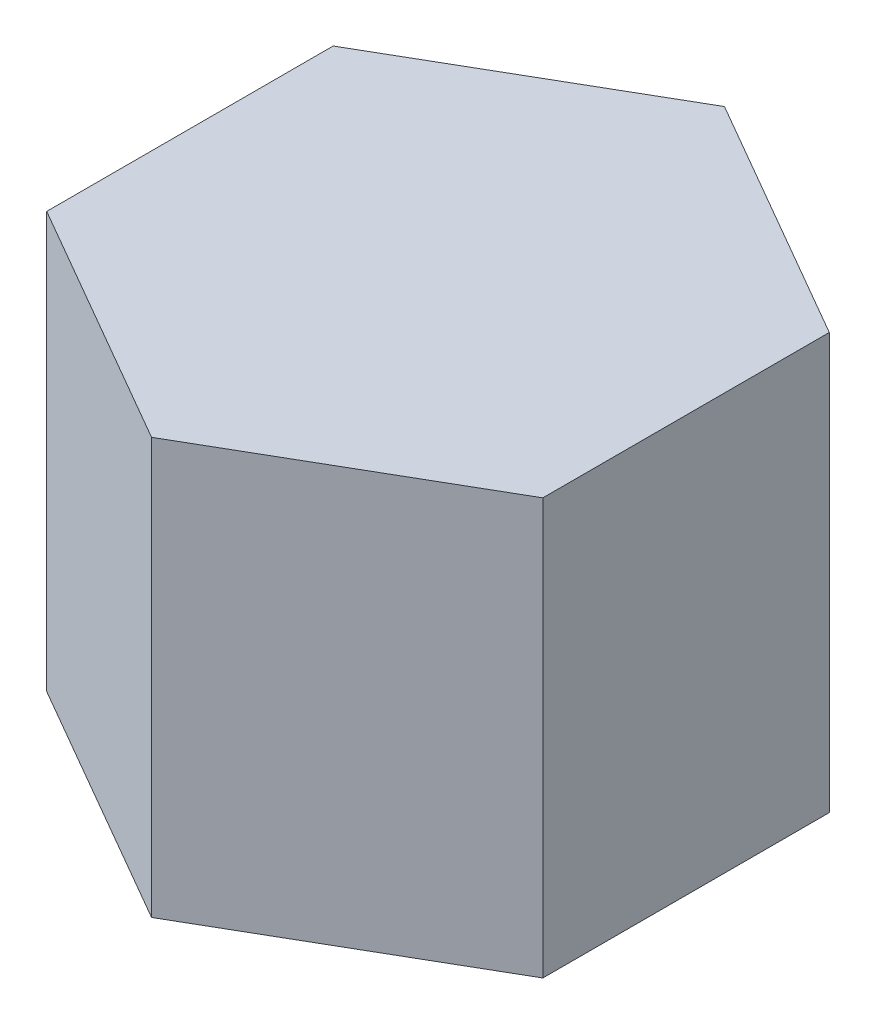
ISO-10303-21;
HEADER;
FILE_DESCRIPTION(('STEP AP214'),'2;1');
FILE_NAME('part.step','',(''),(''),'','','');
FILE_SCHEMA(('AUTOMOTIVE_DESIGN { 1 0 10303 214 1 1 1 1 }'));
ENDSEC;
DATA;
#1=APPLICATION_CONTEXT('core data for automotive mechanical design processes');
#2=APPLICATION_PROTOCOL_DEFINITION('international standard','automotive_design',2000,#1);
#3=PRODUCT_CONTEXT('',#1,'mechanical');
#4=PRODUCT('Part','Part','',(#3));
#5=PRODUCT_RELATED_PRODUCT_CATEGORY('part','',(#4));
#6=PRODUCT_DEFINITION_FORMATION('','',#4);
#7=PRODUCT_DEFINITION_CONTEXT('part definition',#1,'design');
#8=PRODUCT_DEFINITION('design','',#6,#7);
#9=PRODUCT_DEFINITION_SHAPE('','',#8);
#10=(LENGTH_UNIT() NAMED_UNIT(*) SI_UNIT(.MILLI.,.METRE.));
#11=(NAMED_UNIT(*) PLANE_ANGLE_UNIT() SI_UNIT($,.RADIAN.));
#12=(NAMED_UNIT(*) SI_UNIT($,.STERADIAN.) SOLID_ANGLE_UNIT());
#13=UNCERTAINTY_MEASURE_WITH_UNIT(LENGTH_MEASURE(1.E-05),#10,'distance_accuracy_value','');
#14=(GEOMETRIC_REPRESENTATION_CONTEXT(3) GLOBAL_UNCERTAINTY_ASSIGNED_CONTEXT((#13)) GLOBAL_UNIT_ASSIGNED_CONTEXT((#10,
#11,#12)) REPRESENTATION_CONTEXT('',''));
#15=CARTESIAN_POINT('',(0.,0.,0.));
#16=DIRECTION('',(0.,0.,1.));
#17=DIRECTION('',(1.,0.,0.));
#18=AXIS2_PLACEMENT_3D('',#15,#16,#17);
#19=CARTESIAN_POINT('',(210.142660308706,-148.537700895744,288.908895009141));
#20=DIRECTION('',(-0.499999999999943,0.,-0.866025403784472));
#21=DIRECTION('',(-0.866025403784472,0.,0.499999999999943));
#22=AXIS2_PLACEMENT_3D('',#19,#20,#21);
#23=PLANE('',#22);
#24=CARTESIAN_POINT('',(209.839551417382,-149.045793579175,289.083895009141));
#25=DIRECTION('',(0.866025403784471,0.,-0.499999999999943));
#26=VECTOR('',#25,1.);
#27=LINE('',#24,#26);
#28=CARTESIAN_POINT('',(209.839551417382,-149.045793579175,289.083895009141));
#29=VERTEX_POINT('',#28);
#30=CARTESIAN_POINT('',(210.142660308706,-149.045793579175,288.908895009141));
#31=VERTEX_POINT('',#30);
#32=EDGE_CURVE('E170',#29,#31,#27,.T.);
#33=ORIENTED_EDGE('',*,*,#32,.T.);
#34=CARTESIAN_POINT('',(210.142660308706,-148.537700895744,288.908895009141));
#35=DIRECTION('',(0.,-1.,0.));
#36=VECTOR('',#35,1.);
#37=LINE('',#34,#36);
#38=CARTESIAN_POINT('',(210.142660308706,-148.537700895744,288.908895009141));
#39=VERTEX_POINT('',#38);
#40=EDGE_CURVE('E35',#39,#31,#37,.T.);
#41=ORIENTED_EDGE('',*,*,#40,.F.);
#42=CARTESIAN_POINT('',(209.839551417382,-148.537700895744,289.083895009141));
#43=DIRECTION('',(0.866025403784471,0.,-0.499999999999943));
#44=VECTOR('',#43,1.);
#45=LINE('',#42,#44);
#46=CARTESIAN_POINT('',(209.839551417382,-148.537700895744,289.083895009141));
#47=VERTEX_POINT('',#46);
#48=EDGE_CURVE('E159',#47,#39,#45,.T.);
#49=ORIENTED_EDGE('',*,*,#48,.F.);
#50=CARTESIAN_POINT('',(209.839551417382,-148.537700895744,289.083895009141));
#51=DIRECTION('',(0.,-1.,0.));
#52=VECTOR('',#51,1.);
#53=LINE('',#50,#52);
#54=EDGE_CURVE('E10',#47,#29,#53,.T.);
#55=ORIENTED_EDGE('',*,*,#54,.T.);
#56=EDGE_LOOP('',(#33,#41,#49,#55));
#57=FACE_BOUND('',#56,.T.);
#58=ADVANCED_FACE('F16',(#57),#23,.F.);
#59=CARTESIAN_POINT('',(209.839551417382,-148.537700895744,289.083895009141));
#60=DIRECTION('',(0.500000000000062,0.,-0.866025403784403));
#61=DIRECTION('',(-0.866025403784403,0.,-0.500000000000062));
#62=AXIS2_PLACEMENT_3D('',#59,#60,#61);
#63=PLANE('',#62);
#64=CARTESIAN_POINT('',(209.536442526057,-149.045793579175,288.908895009141));
#65=DIRECTION('',(0.866025403784403,0.,0.500000000000062));
#66=VECTOR('',#65,1.);
#67=LINE('',#64,#66);
#68=CARTESIAN_POINT('',(209.536442526057,-149.045793579175,288.908895009141));
#69=VERTEX_POINT('',#68);
#70=EDGE_CURVE('E167',#69,#29,#67,.T.);
#71=ORIENTED_EDGE('',*,*,#70,.T.);
#72=ORIENTED_EDGE('',*,*,#54,.F.);
#73=CARTESIAN_POINT('',(209.536442526057,-148.537700895744,288.908895009141));
#74=DIRECTION('',(0.866025403784403,0.,0.500000000000062));
#75=VECTOR('',#74,1.);
#76=LINE('',#73,#75);
#77=CARTESIAN_POINT('',(209.536442526057,-148.537700895744,288.908895009141));
#78=VERTEX_POINT('',#77);
#79=EDGE_CURVE('E156',#78,#47,#76,.T.);
#80=ORIENTED_EDGE('',*,*,#79,.F.);
#81=CARTESIAN_POINT('',(209.536442526057,-148.537700895744,288.908895009141));
#82=DIRECTION('',(0.,-1.,0.));
#83=VECTOR('',#82,1.);
#84=LINE('',#81,#83);
#85=EDGE_CURVE('E27',#78,#69,#84,.T.);
#86=ORIENTED_EDGE('',*,*,#85,.T.);
#87=EDGE_LOOP('',(#71,#72,#80,#86));
#88=FACE_BOUND('',#87,.T.);
#89=ADVANCED_FACE('F189',(#88),#63,.F.);
#90=CARTESIAN_POINT('',(209.536442526057,-148.537700895744,290.831971220494));
#91=DIRECTION('',(1.,0.,0.));
#92=DIRECTION('',(0.,1.,0.));
#93=AXIS2_PLACEMENT_3D('',#90,#91,#92);
#94=PLANE('',#93);
#95=CARTESIAN_POINT('',(209.536442526057,-149.045793579175,288.558895009141));
#96=DIRECTION('',(0.,0.,1.));
#97=VECTOR('',#96,1.);
#98=LINE('',#95,#97);
#99=CARTESIAN_POINT('',(209.536442526057,-149.045793579175,288.558895009141));
#100=VERTEX_POINT('',#99);
#101=EDGE_CURVE('E163',#100,#69,#98,.T.);
#102=ORIENTED_EDGE('',*,*,#101,.T.);
#103=ORIENTED_EDGE('',*,*,#85,.F.);
#104=CARTESIAN_POINT('',(209.536442526057,-148.537700895744,288.558895009141));
#105=DIRECTION('',(0.,0.,1.));
#106=VECTOR('',#105,1.);
#107=LINE('',#104,#106);
#108=CARTESIAN_POINT('',(209.536442526057,-148.537700895744,288.558895009141));
#109=VERTEX_POINT('',#108);
#110=EDGE_CURVE('E106',#109,#78,#107,.T.);
#111=ORIENTED_EDGE('',*,*,#110,.F.);
#112=CARTESIAN_POINT('',(209.536442526057,-148.537700895744,288.558895009141));
#113=DIRECTION('',(0.,-1.,0.));
#114=VECTOR('',#113,1.);
#115=LINE('',#112,#114);
#116=EDGE_CURVE('E94',#109,#100,#115,.T.);
#117=ORIENTED_EDGE('',*,*,#116,.T.);
#118=EDGE_LOOP('',(#102,#103,#111,#117));
#119=FACE_BOUND('',#118,.T.);
#120=ADVANCED_FACE('F198',(#119),#94,.F.);
#121=CARTESIAN_POINT('',(209.536442526057,-148.537700895744,288.558895009141));
#122=DIRECTION('',(0.499999999999978,0.,0.866025403784452));
#123=DIRECTION('',(0.866025403784452,0.,-0.499999999999978));
#124=AXIS2_PLACEMENT_3D('',#121,#122,#123);
#125=PLANE('',#124);
#126=CARTESIAN_POINT('',(209.839551417382,-149.045793579175,288.383895009141));
#127=DIRECTION('',(-0.866025403784452,0.,0.499999999999978));
#128=VECTOR('',#127,1.);
#129=LINE('',#126,#128);
#130=CARTESIAN_POINT('',(209.839551417382,-149.045793579175,288.383895009141));
#131=VERTEX_POINT('',#130);
#132=EDGE_CURVE('E162',#131,#100,#129,.T.);
#133=ORIENTED_EDGE('',*,*,#132,.T.);
#134=ORIENTED_EDGE('',*,*,#116,.F.);
#135=CARTESIAN_POINT('',(209.839551417382,-148.537700895744,288.383895009141));
#136=DIRECTION('',(-0.866025403784452,0.,0.499999999999978));
#137=VECTOR('',#136,1.);
#138=LINE('',#135,#137);
#139=CARTESIAN_POINT('',(209.839551417382,-148.537700895744,288.383895009141));
#140=VERTEX_POINT('',#139);
#141=EDGE_CURVE('E98',#140,#109,#138,.T.);
#142=ORIENTED_EDGE('',*,*,#141,.F.);
#143=CARTESIAN_POINT('',(209.839551417382,-148.537700895744,288.383895009141));
#144=DIRECTION('',(0.,-1.,0.));
#145=VECTOR('',#144,1.);
#146=LINE('',#143,#145);
#147=EDGE_CURVE('E79',#140,#131,#146,.T.);
#148=ORIENTED_EDGE('',*,*,#147,.T.);
#149=EDGE_LOOP('',(#133,#134,#142,#148));
#150=FACE_BOUND('',#149,.T.);
#151=ADVANCED_FACE('F100',(#150),#125,.F.);
#152=CARTESIAN_POINT('',(209.839551417382,-148.537700895744,288.383895009141));
#153=DIRECTION('',(-0.499999999999943,0.,0.866025403784472));
#154=DIRECTION('',(0.866025403784472,0.,0.499999999999943));
#155=AXIS2_PLACEMENT_3D('',#152,#153,#154);
#156=PLANE('',#155);
#157=CARTESIAN_POINT('',(210.142660308706,-149.045793579175,288.558895009141));
#158=DIRECTION('',(-0.866025403784471,0.,-0.499999999999943));
#159=VECTOR('',#158,1.);
#160=LINE('',#157,#159);
#161=CARTESIAN_POINT('',(210.142660308706,-149.045793579175,288.558895009141));
#162=VERTEX_POINT('',#161);
#163=EDGE_CURVE('E88',#162,#131,#160,.T.);
#164=ORIENTED_EDGE('',*,*,#163,.T.);
#165=ORIENTED_EDGE('',*,*,#147,.F.);
#166=CARTESIAN_POINT('',(210.142660308706,-148.537700895744,288.558895009141));
#167=DIRECTION('',(-0.866025403784471,0.,-0.499999999999943));
#168=VECTOR('',#167,1.);
#169=LINE('',#166,#168);
#170=CARTESIAN_POINT('',(210.142660308706,-148.537700895744,288.558895009141));
#171=VERTEX_POINT('',#170);
#172=EDGE_CURVE('E84',#171,#140,#169,.T.);
#173=ORIENTED_EDGE('',*,*,#172,.F.);
#174=CARTESIAN_POINT('',(210.142660308706,-148.537700895744,288.558895009141));
#175=DIRECTION('',(0.,-1.,0.));
#176=VECTOR('',#175,1.);
#177=LINE('',#174,#176);
#178=EDGE_CURVE('E58',#171,#162,#177,.T.);
#179=ORIENTED_EDGE('',*,*,#178,.T.);
#180=EDGE_LOOP('',(#164,#165,#173,#179));
#181=FACE_BOUND('',#180,.T.);
#182=ADVANCED_FACE('F82',(#181),#156,.F.);
#183=CARTESIAN_POINT('',(210.142660308706,-148.537700895744,290.831971220494));
#184=DIRECTION('',(-1.,0.,0.));
#185=DIRECTION('',(0.,-1.,0.));
#186=AXIS2_PLACEMENT_3D('',#183,#184,#185);
#187=PLANE('',#186);
#188=CARTESIAN_POINT('',(210.142660308706,-149.045793579175,288.908895009141));
#189=DIRECTION('',(0.,0.,-1.));
#190=VECTOR('',#189,1.);
#191=LINE('',#188,#190);
#192=EDGE_CURVE('E160',#31,#162,#191,.T.);
#193=ORIENTED_EDGE('',*,*,#192,.T.);
#194=ORIENTED_EDGE('',*,*,#178,.F.);
#195=CARTESIAN_POINT('',(210.142660308706,-148.537700895744,288.908895009141));
#196=DIRECTION('',(0.,0.,-1.));
#197=VECTOR('',#196,1.);
#198=LINE('',#195,#197);
#199=EDGE_CURVE('E112',#39,#171,#198,.T.);
#200=ORIENTED_EDGE('',*,*,#199,.F.);
#201=ORIENTED_EDGE('',*,*,#40,.T.);
#202=EDGE_LOOP('',(#193,#194,#200,#201));
#203=FACE_BOUND('',#202,.T.);
#204=ADVANCED_FACE('F131',(#203),#187,.F.);
#205=CARTESIAN_POINT('',(206.339551417382,-148.537700895744,290.831971220494));
#206=DIRECTION('',(0.,-1.,0.));
#207=DIRECTION('',(1.,0.,0.));
#208=AXIS2_PLACEMENT_3D('',#205,#206,#207);
#209=PLANE('',#208);
#210=ORIENTED_EDGE('',*,*,#48,.T.);
#211=ORIENTED_EDGE('',*,*,#199,.T.);
#212=ORIENTED_EDGE('',*,*,#172,.T.);
#213=ORIENTED_EDGE('',*,*,#141,.T.);
#214=ORIENTED_EDGE('',*,*,#110,.T.);
#215=ORIENTED_EDGE('',*,*,#79,.T.);
#216=EDGE_LOOP('',(#210,#211,#212,#213,#214,#215));
#217=FACE_BOUND('',#216,.T.);
#218=ADVANCED_FACE('F111',(#217),#209,.F.);
#219=CARTESIAN_POINT('',(206.339551417382,-149.045793579175,290.831971220494));
#220=DIRECTION('',(0.,-1.,0.));
#221=DIRECTION('',(1.,0.,0.));
#222=AXIS2_PLACEMENT_3D('',#219,#220,#221);
#223=PLANE('',#222);
#224=ORIENTED_EDGE('',*,*,#32,.F.);
#225=ORIENTED_EDGE('',*,*,#70,.F.);
#226=ORIENTED_EDGE('',*,*,#101,.F.);
#227=ORIENTED_EDGE('',*,*,#132,.F.);
#228=ORIENTED_EDGE('',*,*,#163,.F.);
#229=ORIENTED_EDGE('',*,*,#192,.F.);
#230=EDGE_LOOP('',(#224,#225,#226,#227,#228,#229));
#231=FACE_BOUND('',#230,.T.);
#232=ADVANCED_FACE('F130',(#231),#223,.T.);
#233=CLOSED_SHELL('',(#58,#89,#120,#151,#182,#204,#218,#232));
#234=MANIFOLD_SOLID_BREP('B1',#233);
#235=ADVANCED_BREP_SHAPE_REPRESENTATION('',(#18,#234),#14);
#236=SHAPE_DEFINITION_REPRESENTATION(#9,#235);
ENDSEC;
END-ISO-10303-21;
